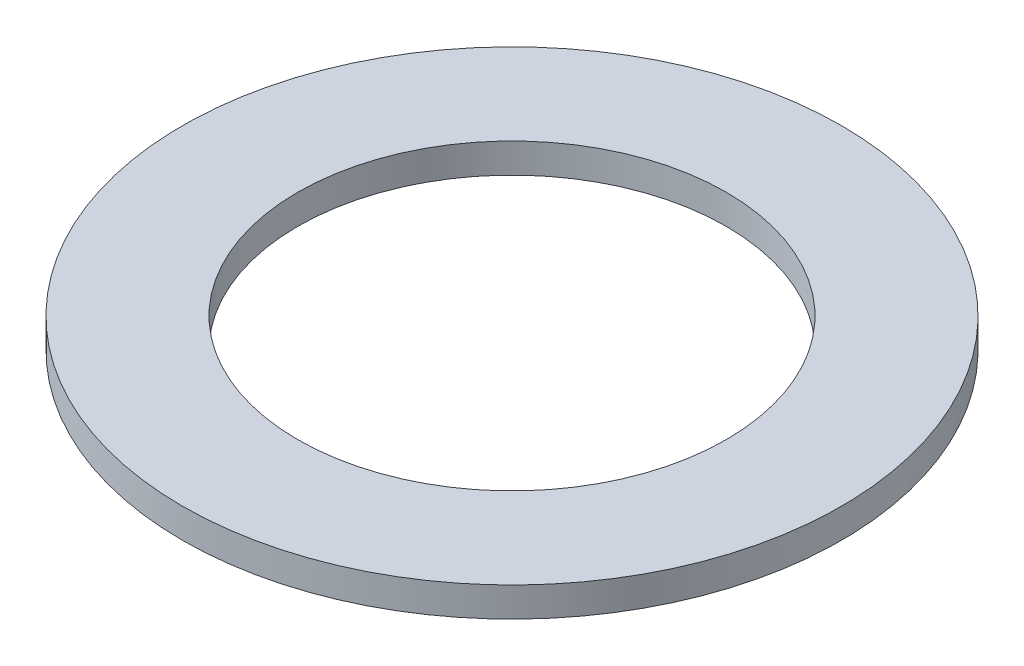
ISO-10303-21;
HEADER;
FILE_DESCRIPTION(('STEP AP214'),'2;1');
FILE_NAME('part.step','',(''),(''),'','','');
FILE_SCHEMA(('AUTOMOTIVE_DESIGN { 1 0 10303 214 1 1 1 1 }'));
ENDSEC;
DATA;
#1=APPLICATION_CONTEXT('core data for automotive mechanical design processes');
#2=APPLICATION_PROTOCOL_DEFINITION('international standard','automotive_design',2000,#1);
#3=PRODUCT_CONTEXT('',#1,'mechanical');
#4=PRODUCT('Part','Part','',(#3));
#5=PRODUCT_RELATED_PRODUCT_CATEGORY('part','',(#4));
#6=PRODUCT_DEFINITION_FORMATION('','',#4);
#7=PRODUCT_DEFINITION_CONTEXT('part definition',#1,'design');
#8=PRODUCT_DEFINITION('design','',#6,#7);
#9=PRODUCT_DEFINITION_SHAPE('','',#8);
#10=(LENGTH_UNIT() NAMED_UNIT(*) SI_UNIT(.MILLI.,.METRE.));
#11=(NAMED_UNIT(*) PLANE_ANGLE_UNIT() SI_UNIT($,.RADIAN.));
#12=(NAMED_UNIT(*) SI_UNIT($,.STERADIAN.) SOLID_ANGLE_UNIT());
#13=UNCERTAINTY_MEASURE_WITH_UNIT(LENGTH_MEASURE(1.E-05),#10,'distance_accuracy_value','');
#14=(GEOMETRIC_REPRESENTATION_CONTEXT(3) GLOBAL_UNCERTAINTY_ASSIGNED_CONTEXT((#13)) GLOBAL_UNIT_ASSIGNED_CONTEXT((#10,
#11,#12)) REPRESENTATION_CONTEXT('',''));
#15=CARTESIAN_POINT('',(0.,0.,0.));
#16=DIRECTION('',(0.,0.,1.));
#17=DIRECTION('',(1.,0.,0.));
#18=AXIS2_PLACEMENT_3D('',#15,#16,#17);
#19=CARTESIAN_POINT('',(0.,1.9812,0.));
#20=DIRECTION('',(0.,1.,0.));
#21=DIRECTION('',(0.,0.,1.));
#22=AXIS2_PLACEMENT_3D('',#19,#20,#21);
#23=PLANE('',#22);
#24=CARTESIAN_POINT('',(0.,1.9812,0.));
#25=DIRECTION('',(0.,1.,0.));
#26=DIRECTION('',(0.,0.,1.));
#27=AXIS2_PLACEMENT_3D('',#24,#25,#26);
#28=CIRCLE('',#27,22.0726);
#29=CARTESIAN_POINT('',(0.,1.9812,22.0726));
#30=VERTEX_POINT('',#29);
#31=EDGE_CURVE('E10',#30,#30,#28,.T.);
#32=ORIENTED_EDGE('',*,*,#31,.T.);
#33=EDGE_LOOP('',(#32));
#34=FACE_BOUND('',#33,.T.);
#35=CARTESIAN_POINT('',(0.,1.9812,0.));
#36=DIRECTION('',(0.,1.,0.));
#37=DIRECTION('',(0.,0.,1.));
#38=AXIS2_PLACEMENT_3D('',#35,#36,#37);
#39=CIRCLE('',#38,14.351);
#40=CARTESIAN_POINT('',(0.,1.9812,14.351));
#41=VERTEX_POINT('',#40);
#42=EDGE_CURVE('E42',#41,#41,#39,.T.);
#43=ORIENTED_EDGE('',*,*,#42,.F.);
#44=EDGE_LOOP('',(#43));
#45=FACE_BOUND('',#44,.T.);
#46=ADVANCED_FACE('F31',(#34,#45),#23,.T.);
#47=CARTESIAN_POINT('',(0.,0.,0.));
#48=DIRECTION('',(0.,1.,0.));
#49=DIRECTION('',(0.,0.,1.));
#50=AXIS2_PLACEMENT_3D('',#47,#48,#49);
#51=PLANE('',#50);
#52=CARTESIAN_POINT('',(0.,0.,0.));
#53=DIRECTION('',(0.,1.,0.));
#54=DIRECTION('',(0.,0.,1.));
#55=AXIS2_PLACEMENT_3D('',#52,#53,#54);
#56=CIRCLE('',#55,22.0726);
#57=CARTESIAN_POINT('',(0.,0.,22.0726));
#58=VERTEX_POINT('',#57);
#59=EDGE_CURVE('E35',#58,#58,#56,.T.);
#60=ORIENTED_EDGE('',*,*,#59,.F.);
#61=EDGE_LOOP('',(#60));
#62=FACE_BOUND('',#61,.T.);
#63=CARTESIAN_POINT('',(0.,0.,0.));
#64=DIRECTION('',(0.,1.,0.));
#65=DIRECTION('',(0.,0.,1.));
#66=AXIS2_PLACEMENT_3D('',#63,#64,#65);
#67=CIRCLE('',#66,14.351);
#68=CARTESIAN_POINT('',(0.,0.,14.351));
#69=VERTEX_POINT('',#68);
#70=EDGE_CURVE('E44',#69,#69,#67,.T.);
#71=ORIENTED_EDGE('',*,*,#70,.T.);
#72=EDGE_LOOP('',(#71));
#73=FACE_BOUND('',#72,.T.);
#74=ADVANCED_FACE('F54',(#62,#73),#51,.F.);
#75=CARTESIAN_POINT('',(0.,1.9812,0.));
#76=DIRECTION('',(0.,-1.,0.));
#77=DIRECTION('',(0.,0.,-1.));
#78=AXIS2_PLACEMENT_3D('',#75,#76,#77);
#79=CYLINDRICAL_SURFACE('',#78,22.0726);
#80=ORIENTED_EDGE('',*,*,#31,.F.);
#81=EDGE_LOOP('',(#80));
#82=FACE_BOUND('',#81,.T.);
#83=ORIENTED_EDGE('',*,*,#59,.T.);
#84=EDGE_LOOP('',(#83));
#85=FACE_BOUND('',#84,.T.);
#86=ADVANCED_FACE('F33',(#82,#85),#79,.T.);
#87=CARTESIAN_POINT('',(0.,1.9812,0.));
#88=DIRECTION('',(0.,-1.,0.));
#89=DIRECTION('',(0.,0.,-1.));
#90=AXIS2_PLACEMENT_3D('',#87,#88,#89);
#91=CYLINDRICAL_SURFACE('',#90,14.351);
#92=ORIENTED_EDGE('',*,*,#42,.T.);
#93=EDGE_LOOP('',(#92));
#94=FACE_BOUND('',#93,.T.);
#95=ORIENTED_EDGE('',*,*,#70,.F.);
#96=EDGE_LOOP('',(#95));
#97=FACE_BOUND('',#96,.T.);
#98=ADVANCED_FACE('F50',(#94,#97),#91,.F.);
#99=CLOSED_SHELL('',(#46,#74,#86,#98));
#100=MANIFOLD_SOLID_BREP('B2',#99);
#101=ADVANCED_BREP_SHAPE_REPRESENTATION('',(#18,#100),#14);
#102=SHAPE_DEFINITION_REPRESENTATION(#9,#101);
ENDSEC;
END-ISO-10303-21;
